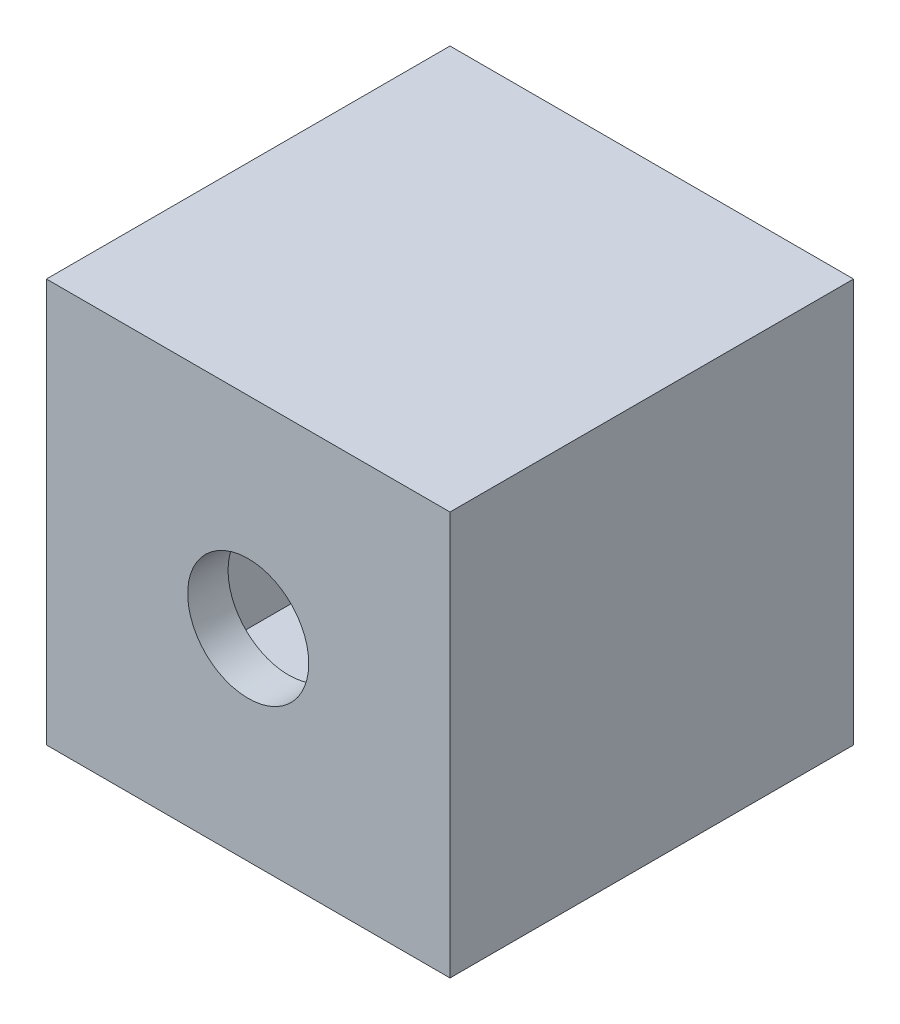
ISO-10303-21;
HEADER;
FILE_DESCRIPTION(('STEP AP214'),'2;1');
FILE_NAME('part.step','',(''),(''),'','','');
FILE_SCHEMA(('AUTOMOTIVE_DESIGN { 1 0 10303 214 1 1 1 1 }'));
ENDSEC;
DATA;
#1=APPLICATION_CONTEXT('core data for automotive mechanical design processes');
#2=APPLICATION_PROTOCOL_DEFINITION('international standard','automotive_design',2000,#1);
#3=PRODUCT_CONTEXT('',#1,'mechanical');
#4=PRODUCT('Part','Part','',(#3));
#5=PRODUCT_RELATED_PRODUCT_CATEGORY('part','',(#4));
#6=PRODUCT_DEFINITION_FORMATION('','',#4);
#7=PRODUCT_DEFINITION_CONTEXT('part definition',#1,'design');
#8=PRODUCT_DEFINITION('design','',#6,#7);
#9=PRODUCT_DEFINITION_SHAPE('','',#8);
#10=(LENGTH_UNIT() NAMED_UNIT(*) SI_UNIT(.MILLI.,.METRE.));
#11=(NAMED_UNIT(*) PLANE_ANGLE_UNIT() SI_UNIT($,.RADIAN.));
#12=(NAMED_UNIT(*) SI_UNIT($,.STERADIAN.) SOLID_ANGLE_UNIT());
#13=UNCERTAINTY_MEASURE_WITH_UNIT(LENGTH_MEASURE(1.E-05),#10,'distance_accuracy_value','');
#14=(GEOMETRIC_REPRESENTATION_CONTEXT(3) GLOBAL_UNCERTAINTY_ASSIGNED_CONTEXT((#13)) GLOBAL_UNIT_ASSIGNED_CONTEXT((#10,
#11,#12)) REPRESENTATION_CONTEXT('',''));
#15=CARTESIAN_POINT('',(0.,0.,0.));
#16=DIRECTION('',(0.,0.,1.));
#17=DIRECTION('',(1.,0.,0.));
#18=AXIS2_PLACEMENT_3D('',#15,#16,#17);
#19=CARTESIAN_POINT('',(0.,0.,0.));
#20=DIRECTION('',(0.,0.,-1.));
#21=DIRECTION('',(-1.,0.,0.));
#22=AXIS2_PLACEMENT_3D('',#19,#20,#21);
#23=PLANE('',#22);
#24=DIRECTION('',(0.,1.,0.));
#25=VECTOR('',#24,1.);
#26=CARTESIAN_POINT('',(100.,-100.,0.));
#27=LINE('',#26,#25);
#28=CARTESIAN_POINT('',(100.,-100.,0.));
#29=VERTEX_POINT('',#28);
#30=CARTESIAN_POINT('',(100.,100.,0.));
#31=VERTEX_POINT('',#30);
#32=EDGE_CURVE('E135',#29,#31,#27,.T.);
#33=ORIENTED_EDGE('',*,*,#32,.F.);
#34=DIRECTION('',(1.,0.,0.));
#35=VECTOR('',#34,1.);
#36=CARTESIAN_POINT('',(-100.,-100.,0.));
#37=LINE('',#36,#35);
#38=CARTESIAN_POINT('',(-100.,-100.,0.));
#39=VERTEX_POINT('',#38);
#40=EDGE_CURVE('E83',#39,#29,#37,.T.);
#41=ORIENTED_EDGE('',*,*,#40,.F.);
#42=DIRECTION('',(0.,-1.,0.));
#43=VECTOR('',#42,1.);
#44=CARTESIAN_POINT('',(-100.,-100.,0.));
#45=LINE('',#44,#43);
#46=CARTESIAN_POINT('',(-100.,100.,0.));
#47=VERTEX_POINT('',#46);
#48=EDGE_CURVE('E165',#47,#39,#45,.T.);
#49=ORIENTED_EDGE('',*,*,#48,.F.);
#50=DIRECTION('',(-1.,0.,0.));
#51=VECTOR('',#50,1.);
#52=CARTESIAN_POINT('',(-100.,100.,0.));
#53=LINE('',#52,#51);
#54=EDGE_CURVE('E139',#31,#47,#53,.T.);
#55=ORIENTED_EDGE('',*,*,#54,.F.);
#56=EDGE_LOOP('',(#33,#41,#49,#55));
#57=FACE_BOUND('',#56,.T.);
#58=DIRECTION('',(1.,0.,0.));
#59=VECTOR('',#58,1.);
#60=CARTESIAN_POINT('',(0.,-80.,0.));
#61=LINE('',#60,#59);
#62=CARTESIAN_POINT('',(-80.,-80.,0.));
#63=VERTEX_POINT('',#62);
#64=CARTESIAN_POINT('',(80.,-80.,0.));
#65=VERTEX_POINT('',#64);
#66=EDGE_CURVE('E130',#63,#65,#61,.T.);
#67=ORIENTED_EDGE('',*,*,#66,.T.);
#68=DIRECTION('',(0.,1.,0.));
#69=VECTOR('',#68,1.);
#70=CARTESIAN_POINT('',(80.,0.,0.));
#71=LINE('',#70,#69);
#72=CARTESIAN_POINT('',(80.,80.,0.));
#73=VERTEX_POINT('',#72);
#74=EDGE_CURVE('E151',#65,#73,#71,.T.);
#75=ORIENTED_EDGE('',*,*,#74,.T.);
#76=DIRECTION('',(-1.,0.,0.));
#77=VECTOR('',#76,1.);
#78=CARTESIAN_POINT('',(0.,80.,0.));
#79=LINE('',#78,#77);
#80=CARTESIAN_POINT('',(-80.,80.,0.));
#81=VERTEX_POINT('',#80);
#82=EDGE_CURVE('E134',#73,#81,#79,.T.);
#83=ORIENTED_EDGE('',*,*,#82,.T.);
#84=DIRECTION('',(0.,-1.,0.));
#85=VECTOR('',#84,1.);
#86=CARTESIAN_POINT('',(-80.,0.,0.));
#87=LINE('',#86,#85);
#88=EDGE_CURVE('E53',#81,#63,#87,.T.);
#89=ORIENTED_EDGE('',*,*,#88,.T.);
#90=EDGE_LOOP('',(#67,#75,#83,#89));
#91=FACE_BOUND('',#90,.T.);
#92=ADVANCED_FACE('F37',(#57,#91),#23,.T.);
#93=CARTESIAN_POINT('',(100.,-100.,200.));
#94=DIRECTION('',(-1.,0.,0.));
#95=DIRECTION('',(0.,0.,1.));
#96=AXIS2_PLACEMENT_3D('',#93,#94,#95);
#97=PLANE('',#96);
#98=ORIENTED_EDGE('',*,*,#32,.T.);
#99=DIRECTION('',(0.,0.,-1.));
#100=VECTOR('',#99,1.);
#101=CARTESIAN_POINT('',(100.,100.,200.));
#102=LINE('',#101,#100);
#103=CARTESIAN_POINT('',(100.,100.,200.));
#104=VERTEX_POINT('',#103);
#105=EDGE_CURVE('E11',#104,#31,#102,.T.);
#106=ORIENTED_EDGE('',*,*,#105,.F.);
#107=DIRECTION('',(0.,1.,0.));
#108=VECTOR('',#107,1.);
#109=CARTESIAN_POINT('',(100.,-100.,200.));
#110=LINE('',#109,#108);
#111=CARTESIAN_POINT('',(100.,-100.,200.));
#112=VERTEX_POINT('',#111);
#113=EDGE_CURVE('E157',#112,#104,#110,.T.);
#114=ORIENTED_EDGE('',*,*,#113,.F.);
#115=DIRECTION('',(0.,0.,-1.));
#116=VECTOR('',#115,1.);
#117=CARTESIAN_POINT('',(100.,-100.,200.));
#118=LINE('',#117,#116);
#119=EDGE_CURVE('E162',#112,#29,#118,.T.);
#120=ORIENTED_EDGE('',*,*,#119,.T.);
#121=EDGE_LOOP('',(#98,#106,#114,#120));
#122=FACE_BOUND('',#121,.T.);
#123=ADVANCED_FACE('F39',(#122),#97,.F.);
#124=CARTESIAN_POINT('',(-100.,100.,200.));
#125=DIRECTION('',(0.,-1.,0.));
#126=DIRECTION('',(0.,0.,-1.));
#127=AXIS2_PLACEMENT_3D('',#124,#125,#126);
#128=PLANE('',#127);
#129=ORIENTED_EDGE('',*,*,#54,.T.);
#130=DIRECTION('',(0.,0.,-1.));
#131=VECTOR('',#130,1.);
#132=CARTESIAN_POINT('',(-100.,100.,200.));
#133=LINE('',#132,#131);
#134=CARTESIAN_POINT('',(-100.,100.,200.));
#135=VERTEX_POINT('',#134);
#136=EDGE_CURVE('E46',#135,#47,#133,.T.);
#137=ORIENTED_EDGE('',*,*,#136,.F.);
#138=DIRECTION('',(-1.,0.,0.));
#139=VECTOR('',#138,1.);
#140=CARTESIAN_POINT('',(-100.,100.,200.));
#141=LINE('',#140,#139);
#142=EDGE_CURVE('E90',#104,#135,#141,.T.);
#143=ORIENTED_EDGE('',*,*,#142,.F.);
#144=ORIENTED_EDGE('',*,*,#105,.T.);
#145=EDGE_LOOP('',(#129,#137,#143,#144));
#146=FACE_BOUND('',#145,.T.);
#147=ADVANCED_FACE('F193',(#146),#128,.F.);
#148=CARTESIAN_POINT('',(-100.,-100.,200.));
#149=DIRECTION('',(1.,0.,0.));
#150=DIRECTION('',(0.,0.,-1.));
#151=AXIS2_PLACEMENT_3D('',#148,#149,#150);
#152=PLANE('',#151);
#153=ORIENTED_EDGE('',*,*,#48,.T.);
#154=DIRECTION('',(0.,0.,-1.));
#155=VECTOR('',#154,1.);
#156=CARTESIAN_POINT('',(-100.,-100.,200.));
#157=LINE('',#156,#155);
#158=CARTESIAN_POINT('',(-100.,-100.,200.));
#159=VERTEX_POINT('',#158);
#160=EDGE_CURVE('E169',#159,#39,#157,.T.);
#161=ORIENTED_EDGE('',*,*,#160,.F.);
#162=DIRECTION('',(0.,-1.,0.));
#163=VECTOR('',#162,1.);
#164=CARTESIAN_POINT('',(-100.,-100.,200.));
#165=LINE('',#164,#163);
#166=EDGE_CURVE('E160',#135,#159,#165,.T.);
#167=ORIENTED_EDGE('',*,*,#166,.F.);
#168=ORIENTED_EDGE('',*,*,#136,.T.);
#169=EDGE_LOOP('',(#153,#161,#167,#168));
#170=FACE_BOUND('',#169,.T.);
#171=ADVANCED_FACE('F175',(#170),#152,.F.);
#172=CARTESIAN_POINT('',(-100.,-100.,200.));
#173=DIRECTION('',(0.,1.,0.));
#174=DIRECTION('',(0.,0.,1.));
#175=AXIS2_PLACEMENT_3D('',#172,#173,#174);
#176=PLANE('',#175);
#177=ORIENTED_EDGE('',*,*,#40,.T.);
#178=ORIENTED_EDGE('',*,*,#119,.F.);
#179=DIRECTION('',(1.,0.,0.));
#180=VECTOR('',#179,1.);
#181=CARTESIAN_POINT('',(-100.,-100.,200.));
#182=LINE('',#181,#180);
#183=EDGE_CURVE('E62',#159,#112,#182,.T.);
#184=ORIENTED_EDGE('',*,*,#183,.F.);
#185=ORIENTED_EDGE('',*,*,#160,.T.);
#186=EDGE_LOOP('',(#177,#178,#184,#185));
#187=FACE_BOUND('',#186,.T.);
#188=ADVANCED_FACE('F183',(#187),#176,.F.);
#189=CARTESIAN_POINT('',(0.,0.,200.));
#190=DIRECTION('',(0.,0.,-1.));
#191=DIRECTION('',(-1.,0.,0.));
#192=AXIS2_PLACEMENT_3D('',#189,#190,#191);
#193=PLANE('',#192);
#194=CARTESIAN_POINT('',(0.,0.,200.));
#195=DIRECTION('',(0.,0.,1.));
#196=DIRECTION('',(1.,0.,0.));
#197=AXIS2_PLACEMENT_3D('',#194,#195,#196);
#198=CIRCLE('',#197,30.);
#199=CARTESIAN_POINT('',(30.,0.,200.));
#200=VERTEX_POINT('',#199);
#201=EDGE_CURVE('E144',#200,#200,#198,.T.);
#202=ORIENTED_EDGE('',*,*,#201,.F.);
#203=EDGE_LOOP('',(#202));
#204=FACE_BOUND('',#203,.T.);
#205=ORIENTED_EDGE('',*,*,#113,.T.);
#206=ORIENTED_EDGE('',*,*,#142,.T.);
#207=ORIENTED_EDGE('',*,*,#166,.T.);
#208=ORIENTED_EDGE('',*,*,#183,.T.);
#209=EDGE_LOOP('',(#205,#206,#207,#208));
#210=FACE_BOUND('',#209,.T.);
#211=ADVANCED_FACE('F185',(#204,#210),#193,.F.);
#212=CARTESIAN_POINT('',(80.,-100.,200.));
#213=DIRECTION('',(-1.,0.,0.));
#214=DIRECTION('',(0.,0.,1.));
#215=AXIS2_PLACEMENT_3D('',#212,#213,#214);
#216=PLANE('',#215);
#217=ORIENTED_EDGE('',*,*,#74,.F.);
#218=DIRECTION('',(0.,0.,-1.));
#219=VECTOR('',#218,1.);
#220=CARTESIAN_POINT('',(80.,-80.,200.));
#221=LINE('',#220,#219);
#222=CARTESIAN_POINT('',(80.,-80.,180.));
#223=VERTEX_POINT('',#222);
#224=EDGE_CURVE('E129',#223,#65,#221,.T.);
#225=ORIENTED_EDGE('',*,*,#224,.F.);
#226=DIRECTION('',(0.,1.,0.));
#227=VECTOR('',#226,1.);
#228=CARTESIAN_POINT('',(80.,0.,180.));
#229=LINE('',#228,#227);
#230=CARTESIAN_POINT('',(80.,80.,180.));
#231=VERTEX_POINT('',#230);
#232=EDGE_CURVE('E117',#223,#231,#229,.T.);
#233=ORIENTED_EDGE('',*,*,#232,.T.);
#234=DIRECTION('',(0.,0.,-1.));
#235=VECTOR('',#234,1.);
#236=CARTESIAN_POINT('',(80.,80.,200.));
#237=LINE('',#236,#235);
#238=EDGE_CURVE('E127',#231,#73,#237,.T.);
#239=ORIENTED_EDGE('',*,*,#238,.T.);
#240=EDGE_LOOP('',(#217,#225,#233,#239));
#241=FACE_BOUND('',#240,.T.);
#242=ADVANCED_FACE('F126',(#241),#216,.T.);
#243=CARTESIAN_POINT('',(-100.,80.,200.));
#244=DIRECTION('',(0.,-1.,0.));
#245=DIRECTION('',(0.,0.,-1.));
#246=AXIS2_PLACEMENT_3D('',#243,#244,#245);
#247=PLANE('',#246);
#248=ORIENTED_EDGE('',*,*,#82,.F.);
#249=ORIENTED_EDGE('',*,*,#238,.F.);
#250=DIRECTION('',(-1.,0.,0.));
#251=VECTOR('',#250,1.);
#252=CARTESIAN_POINT('',(0.,80.,180.));
#253=LINE('',#252,#251);
#254=CARTESIAN_POINT('',(-80.,80.,180.));
#255=VERTEX_POINT('',#254);
#256=EDGE_CURVE('E113',#231,#255,#253,.T.);
#257=ORIENTED_EDGE('',*,*,#256,.T.);
#258=DIRECTION('',(0.,0.,-1.));
#259=VECTOR('',#258,1.);
#260=CARTESIAN_POINT('',(-80.,80.,200.));
#261=LINE('',#260,#259);
#262=EDGE_CURVE('E136',#255,#81,#261,.T.);
#263=ORIENTED_EDGE('',*,*,#262,.T.);
#264=EDGE_LOOP('',(#248,#249,#257,#263));
#265=FACE_BOUND('',#264,.T.);
#266=ADVANCED_FACE('F132',(#265),#247,.T.);
#267=CARTESIAN_POINT('',(-80.,-100.,200.));
#268=DIRECTION('',(1.,0.,0.));
#269=DIRECTION('',(0.,0.,-1.));
#270=AXIS2_PLACEMENT_3D('',#267,#268,#269);
#271=PLANE('',#270);
#272=ORIENTED_EDGE('',*,*,#88,.F.);
#273=ORIENTED_EDGE('',*,*,#262,.F.);
#274=DIRECTION('',(0.,-1.,0.));
#275=VECTOR('',#274,1.);
#276=CARTESIAN_POINT('',(-80.,0.,180.));
#277=LINE('',#276,#275);
#278=CARTESIAN_POINT('',(-80.,-80.,180.));
#279=VERTEX_POINT('',#278);
#280=EDGE_CURVE('E118',#255,#279,#277,.T.);
#281=ORIENTED_EDGE('',*,*,#280,.T.);
#282=DIRECTION('',(0.,0.,-1.));
#283=VECTOR('',#282,1.);
#284=CARTESIAN_POINT('',(-80.,-80.,200.));
#285=LINE('',#284,#283);
#286=EDGE_CURVE('E141',#279,#63,#285,.T.);
#287=ORIENTED_EDGE('',*,*,#286,.T.);
#288=EDGE_LOOP('',(#272,#273,#281,#287));
#289=FACE_BOUND('',#288,.T.);
#290=ADVANCED_FACE('F208',(#289),#271,.T.);
#291=CARTESIAN_POINT('',(-100.,-80.,200.));
#292=DIRECTION('',(0.,1.,0.));
#293=DIRECTION('',(0.,0.,1.));
#294=AXIS2_PLACEMENT_3D('',#291,#292,#293);
#295=PLANE('',#294);
#296=ORIENTED_EDGE('',*,*,#66,.F.);
#297=ORIENTED_EDGE('',*,*,#286,.F.);
#298=DIRECTION('',(1.,0.,0.));
#299=VECTOR('',#298,1.);
#300=CARTESIAN_POINT('',(0.,-80.,180.));
#301=LINE('',#300,#299);
#302=EDGE_CURVE('E146',#279,#223,#301,.T.);
#303=ORIENTED_EDGE('',*,*,#302,.T.);
#304=ORIENTED_EDGE('',*,*,#224,.T.);
#305=EDGE_LOOP('',(#296,#297,#303,#304));
#306=FACE_BOUND('',#305,.T.);
#307=ADVANCED_FACE('F204',(#306),#295,.T.);
#308=CARTESIAN_POINT('',(0.,0.,180.));
#309=DIRECTION('',(0.,0.,-1.));
#310=DIRECTION('',(-1.,0.,0.));
#311=AXIS2_PLACEMENT_3D('',#308,#309,#310);
#312=PLANE('',#311);
#313=CARTESIAN_POINT('',(0.,0.,180.));
#314=DIRECTION('',(0.,0.,-1.));
#315=DIRECTION('',(-1.,0.,0.));
#316=AXIS2_PLACEMENT_3D('',#313,#314,#315);
#317=CIRCLE('',#316,30.);
#318=CARTESIAN_POINT('',(-30.,0.,180.));
#319=VERTEX_POINT('',#318);
#320=EDGE_CURVE('E41',#319,#319,#317,.T.);
#321=ORIENTED_EDGE('',*,*,#320,.F.);
#322=EDGE_LOOP('',(#321));
#323=FACE_BOUND('',#322,.T.);
#324=ORIENTED_EDGE('',*,*,#232,.F.);
#325=ORIENTED_EDGE('',*,*,#302,.F.);
#326=ORIENTED_EDGE('',*,*,#280,.F.);
#327=ORIENTED_EDGE('',*,*,#256,.F.);
#328=EDGE_LOOP('',(#324,#325,#326,#327));
#329=FACE_BOUND('',#328,.T.);
#330=ADVANCED_FACE('F115',(#323,#329),#312,.T.);
#331=CARTESIAN_POINT('',(0.,0.,148.4));
#332=DIRECTION('',(0.,0.,1.));
#333=DIRECTION('',(1.,0.,0.));
#334=AXIS2_PLACEMENT_3D('',#331,#332,#333);
#335=CYLINDRICAL_SURFACE('',#334,30.);
#336=ORIENTED_EDGE('',*,*,#320,.T.);
#337=EDGE_LOOP('',(#336));
#338=FACE_BOUND('',#337,.T.);
#339=ORIENTED_EDGE('',*,*,#201,.T.);
#340=EDGE_LOOP('',(#339));
#341=FACE_BOUND('',#340,.T.);
#342=ADVANCED_FACE('F203',(#338,#341),#335,.F.);
#343=CLOSED_SHELL('',(#92,#123,#147,#171,#188,#211,#242,#266,#290,#307,#330,#342));
#344=MANIFOLD_SOLID_BREP('B2',#343);
#345=ADVANCED_BREP_SHAPE_REPRESENTATION('',(#18,#344),#14);
#346=SHAPE_DEFINITION_REPRESENTATION(#9,#345);
ENDSEC;
END-ISO-10303-21;
